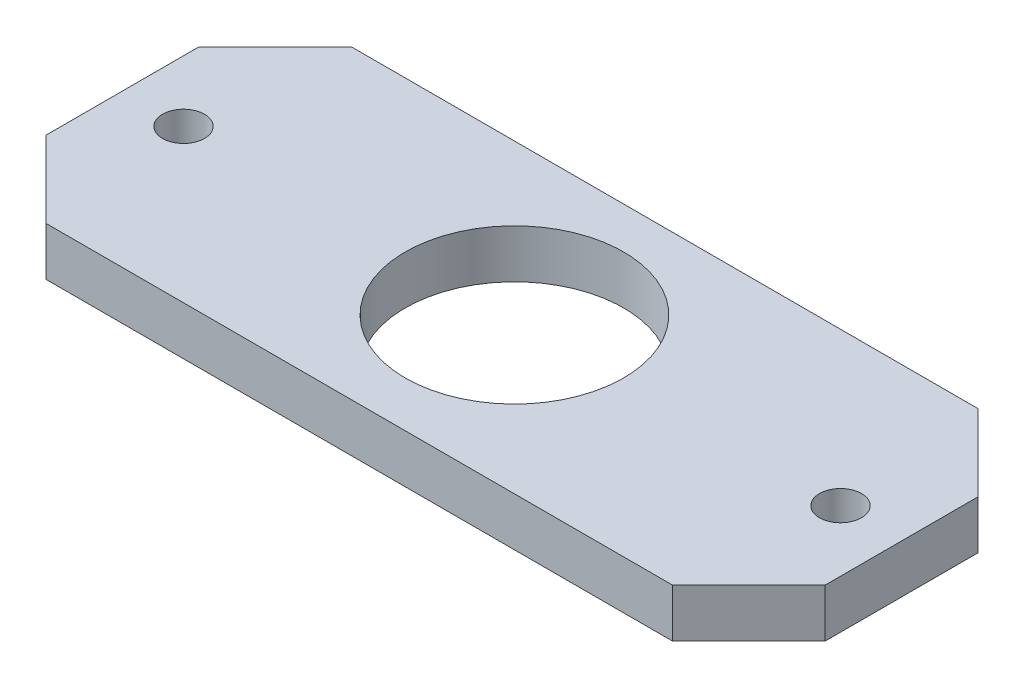
ISO-10303-21;
HEADER;
FILE_DESCRIPTION(('STEP AP214'),'2;1');
FILE_NAME('part.step','',(''),(''),'','','');
FILE_SCHEMA(('AUTOMOTIVE_DESIGN { 1 0 10303 214 1 1 1 1 }'));
ENDSEC;
DATA;
#1=APPLICATION_CONTEXT('core data for automotive mechanical design processes');
#2=APPLICATION_PROTOCOL_DEFINITION('international standard','automotive_design',2000,#1);
#3=PRODUCT_CONTEXT('',#1,'mechanical');
#4=PRODUCT('Part','Part','',(#3));
#5=PRODUCT_RELATED_PRODUCT_CATEGORY('part','',(#4));
#6=PRODUCT_DEFINITION_FORMATION('','',#4);
#7=PRODUCT_DEFINITION_CONTEXT('part definition',#1,'design');
#8=PRODUCT_DEFINITION('design','',#6,#7);
#9=PRODUCT_DEFINITION_SHAPE('','',#8);
#10=(LENGTH_UNIT() NAMED_UNIT(*) SI_UNIT(.MILLI.,.METRE.));
#11=(NAMED_UNIT(*) PLANE_ANGLE_UNIT() SI_UNIT($,.RADIAN.));
#12=(NAMED_UNIT(*) SI_UNIT($,.STERADIAN.) SOLID_ANGLE_UNIT());
#13=UNCERTAINTY_MEASURE_WITH_UNIT(LENGTH_MEASURE(1.E-05),#10,'distance_accuracy_value','');
#14=(GEOMETRIC_REPRESENTATION_CONTEXT(3) GLOBAL_UNCERTAINTY_ASSIGNED_CONTEXT((#13)) GLOBAL_UNIT_ASSIGNED_CONTEXT((#10,
#11,#12)) REPRESENTATION_CONTEXT('',''));
#15=CARTESIAN_POINT('',(0.,0.,0.));
#16=DIRECTION('',(0.,0.,1.));
#17=DIRECTION('',(1.,0.,0.));
#18=AXIS2_PLACEMENT_3D('',#15,#16,#17);
#19=CARTESIAN_POINT('',(0.,6.35,0.));
#20=DIRECTION('',(0.,-1.,0.));
#21=DIRECTION('',(0.,0.,-1.));
#22=AXIS2_PLACEMENT_3D('',#19,#20,#21);
#23=PLANE('',#22);
#24=DIRECTION('',(1.,0.,0.));
#25=VECTOR('',#24,1.);
#26=CARTESIAN_POINT('',(-14.1959183939378,6.35,-8.76310778368405));
#27=LINE('',#26,#25);
#28=CARTESIAN_POINT('',(-0.795399125952209,6.35,-8.76310778368405));
#29=VERTEX_POINT('',#28);
#30=CARTESIAN_POINT('',(81.2046008532428,6.35,-8.76310778368406));
#31=VERTEX_POINT('',#30);
#32=EDGE_CURVE('E64',#29,#31,#27,.T.);
#33=ORIENTED_EDGE('',*,*,#32,.T.);
#34=DIRECTION('',(-0.707106781186549,0.,0.707106781186546));
#35=VECTOR('',#34,1.);
#36=CARTESIAN_POINT('',(91.2046008636453,6.35,-18.7631077940865));
#37=LINE('',#36,#35);
#38=CARTESIAN_POINT('',(91.2046008636453,6.35,-18.7631077940865));
#39=VERTEX_POINT('',#38);
#40=EDGE_CURVE('E145',#31,#39,#37,.F.);
#41=ORIENTED_EDGE('',*,*,#40,.T.);
#42=DIRECTION('',(0.,0.,1.));
#43=VECTOR('',#42,1.);
#44=CARTESIAN_POINT('',(91.2046008636453,6.35,6.23689220591347));
#45=LINE('',#44,#43);
#46=CARTESIAN_POINT('',(91.2046008636453,6.35,-38.7631077940866));
#47=VERTEX_POINT('',#46);
#48=EDGE_CURVE('E157',#47,#39,#45,.T.);
#49=ORIENTED_EDGE('',*,*,#48,.F.);
#50=DIRECTION('',(0.707106781186549,0.,0.707106781186546));
#51=VECTOR('',#50,1.);
#52=CARTESIAN_POINT('',(91.2046008636453,6.35,-38.7631077940866));
#53=LINE('',#52,#51);
#54=CARTESIAN_POINT('',(81.2046008740478,6.35,-48.7631077836841));
#55=VERTEX_POINT('',#54);
#56=EDGE_CURVE('E142',#47,#55,#53,.F.);
#57=ORIENTED_EDGE('',*,*,#56,.T.);
#58=DIRECTION('',(-1.,0.,0.));
#59=VECTOR('',#58,1.);
#60=CARTESIAN_POINT('',(-14.1959183939377,6.35,-48.7631077836841));
#61=LINE('',#60,#59);
#62=CARTESIAN_POINT('',(-0.795399146757168,6.35,-48.7631077836841));
#63=VERTEX_POINT('',#62);
#64=EDGE_CURVE('E121',#55,#63,#61,.T.);
#65=ORIENTED_EDGE('',*,*,#64,.T.);
#66=DIRECTION('',(0.707106781186549,0.,-0.707106781186546));
#67=VECTOR('',#66,1.);
#68=CARTESIAN_POINT('',(-10.7953991363547,6.35,-38.7631077940866));
#69=LINE('',#68,#67);
#70=CARTESIAN_POINT('',(-10.7953991363547,6.35,-38.7631077940866));
#71=VERTEX_POINT('',#70);
#72=EDGE_CURVE('E140',#63,#71,#69,.F.);
#73=ORIENTED_EDGE('',*,*,#72,.T.);
#74=DIRECTION('',(0.,0.,-1.));
#75=VECTOR('',#74,1.);
#76=CARTESIAN_POINT('',(-10.7953991363547,6.35,6.23689220591347));
#77=LINE('',#76,#75);
#78=CARTESIAN_POINT('',(-10.7953991363547,6.35,-18.7631077940865));
#79=VERTEX_POINT('',#78);
#80=EDGE_CURVE('E150',#79,#71,#77,.T.);
#81=ORIENTED_EDGE('',*,*,#80,.F.);
#82=DIRECTION('',(-0.707106781186549,0.,-0.707106781186546));
#83=VECTOR('',#82,1.);
#84=CARTESIAN_POINT('',(-10.7953991363547,6.35,-18.7631077940865));
#85=LINE('',#84,#83);
#86=EDGE_CURVE('E138',#79,#29,#85,.F.);
#87=ORIENTED_EDGE('',*,*,#86,.T.);
#88=EDGE_LOOP('',(#33,#41,#49,#57,#65,#73,#81,#87));
#89=FACE_BOUND('',#88,.T.);
#90=CARTESIAN_POINT('',(-2.79539913635471,6.35,-28.7631077926537));
#91=DIRECTION('',(0.,-1.,0.));
#92=DIRECTION('',(0.,0.,-1.));
#93=AXIS2_PLACEMENT_3D('',#90,#91,#92);
#94=CIRCLE('',#93,2.75);
#95=CARTESIAN_POINT('',(-2.79539913635471,6.35,-31.5131077926537));
#96=VERTEX_POINT('',#95);
#97=EDGE_CURVE('E183',#96,#96,#94,.T.);
#98=ORIENTED_EDGE('',*,*,#97,.T.);
#99=EDGE_LOOP('',(#98));
#100=FACE_BOUND('',#99,.T.);
#101=CARTESIAN_POINT('',(83.2046008636453,6.35,-28.7631077836841));
#102=DIRECTION('',(0.,-1.,0.));
#103=DIRECTION('',(0.,0.,-1.));
#104=AXIS2_PLACEMENT_3D('',#101,#102,#103);
#105=CIRCLE('',#104,2.75000000000001);
#106=CARTESIAN_POINT('',(83.2046008636453,6.35,-31.5131077836841));
#107=VERTEX_POINT('',#106);
#108=EDGE_CURVE('E185',#107,#107,#105,.T.);
#109=ORIENTED_EDGE('',*,*,#108,.T.);
#110=EDGE_LOOP('',(#109));
#111=FACE_BOUND('',#110,.T.);
#112=CARTESIAN_POINT('',(40.2450257051164,6.35,-29.0406949992175));
#113=DIRECTION('',(0.,1.,0.));
#114=DIRECTION('',(0.,0.,1.));
#115=AXIS2_PLACEMENT_3D('',#112,#113,#114);
#116=CIRCLE('',#115,14.295);
#117=CARTESIAN_POINT('',(40.2450257051164,6.35,-14.7456949992175));
#118=VERTEX_POINT('',#117);
#119=EDGE_CURVE('E159',#118,#118,#116,.T.);
#120=ORIENTED_EDGE('',*,*,#119,.F.);
#121=EDGE_LOOP('',(#120));
#122=FACE_BOUND('',#121,.T.);
#123=ADVANCED_FACE('F40',(#89,#100,#111,#122),#23,.F.);
#124=CARTESIAN_POINT('',(0.,0.,0.));
#125=DIRECTION('',(0.,-1.,0.));
#126=DIRECTION('',(0.,0.,-1.));
#127=AXIS2_PLACEMENT_3D('',#124,#125,#126);
#128=PLANE('',#127);
#129=CARTESIAN_POINT('',(-2.79539913635471,0.,-28.7631077926537));
#130=DIRECTION('',(0.,-1.,0.));
#131=DIRECTION('',(0.,0.,-1.));
#132=AXIS2_PLACEMENT_3D('',#129,#130,#131);
#133=CIRCLE('',#132,2.75);
#134=CARTESIAN_POINT('',(-2.79539913635471,0.,-31.5131077926537));
#135=VERTEX_POINT('',#134);
#136=EDGE_CURVE('E190',#135,#135,#133,.T.);
#137=ORIENTED_EDGE('',*,*,#136,.F.);
#138=EDGE_LOOP('',(#137));
#139=FACE_BOUND('',#138,.T.);
#140=CARTESIAN_POINT('',(83.2046008636453,0.,-28.7631077836841));
#141=DIRECTION('',(0.,-1.,0.));
#142=DIRECTION('',(0.,0.,-1.));
#143=AXIS2_PLACEMENT_3D('',#140,#141,#142);
#144=CIRCLE('',#143,2.75000000000001);
#145=CARTESIAN_POINT('',(83.2046008636453,0.,-31.5131077836841));
#146=VERTEX_POINT('',#145);
#147=EDGE_CURVE('E191',#146,#146,#144,.T.);
#148=ORIENTED_EDGE('',*,*,#147,.F.);
#149=EDGE_LOOP('',(#148));
#150=FACE_BOUND('',#149,.T.);
#151=CARTESIAN_POINT('',(40.2450257051164,0.,-29.0406949992175));
#152=DIRECTION('',(0.,1.,0.));
#153=DIRECTION('',(0.,0.,1.));
#154=AXIS2_PLACEMENT_3D('',#151,#152,#153);
#155=CIRCLE('',#154,14.295);
#156=CARTESIAN_POINT('',(40.2450257051164,0.,-14.7456949992175));
#157=VERTEX_POINT('',#156);
#158=EDGE_CURVE('E166',#157,#157,#155,.T.);
#159=ORIENTED_EDGE('',*,*,#158,.T.);
#160=EDGE_LOOP('',(#159));
#161=FACE_BOUND('',#160,.T.);
#162=DIRECTION('',(0.707106781186549,0.,-0.707106781186546));
#163=VECTOR('',#162,1.);
#164=CARTESIAN_POINT('',(36.2207465347792,0.,36.2207465347794));
#165=LINE('',#164,#163);
#166=CARTESIAN_POINT('',(91.2046008636453,0.,-18.7631077940865));
#167=VERTEX_POINT('',#166);
#168=CARTESIAN_POINT('',(81.2046008532428,0.,-8.76310778368405));
#169=VERTEX_POINT('',#168);
#170=EDGE_CURVE('E120',#167,#169,#165,.F.);
#171=ORIENTED_EDGE('',*,*,#170,.T.);
#172=DIRECTION('',(-1.,0.,0.));
#173=VECTOR('',#172,1.);
#174=CARTESIAN_POINT('',(-14.1959183939378,0.,-8.76310778368405));
#175=LINE('',#174,#173);
#176=CARTESIAN_POINT('',(-0.79539912595221,0.,-8.76310778368405));
#177=VERTEX_POINT('',#176);
#178=EDGE_CURVE('E106',#169,#177,#175,.T.);
#179=ORIENTED_EDGE('',*,*,#178,.T.);
#180=DIRECTION('',(0.707106781186549,0.,0.707106781186546));
#181=VECTOR('',#180,1.);
#182=CARTESIAN_POINT('',(3.98385432886592,0.,-3.98385432886594));
#183=LINE('',#182,#181);
#184=CARTESIAN_POINT('',(-10.7953991363547,0.,-18.7631077940865));
#185=VERTEX_POINT('',#184);
#186=EDGE_CURVE('E117',#177,#185,#183,.F.);
#187=ORIENTED_EDGE('',*,*,#186,.T.);
#188=DIRECTION('',(0.,0.,1.));
#189=VECTOR('',#188,1.);
#190=CARTESIAN_POINT('',(-10.7953991363547,0.,6.23689220591347));
#191=LINE('',#190,#189);
#192=CARTESIAN_POINT('',(-10.7953991363547,0.,-38.7631077940866));
#193=VERTEX_POINT('',#192);
#194=EDGE_CURVE('E152',#193,#185,#191,.T.);
#195=ORIENTED_EDGE('',*,*,#194,.F.);
#196=DIRECTION('',(-0.707106781186549,0.,0.707106781186546));
#197=VECTOR('',#196,1.);
#198=CARTESIAN_POINT('',(-24.7792534652206,0.,-24.7792534652207));
#199=LINE('',#198,#197);
#200=CARTESIAN_POINT('',(-0.795399146757164,0.,-48.7631077836841));
#201=VERTEX_POINT('',#200);
#202=EDGE_CURVE('E125',#193,#201,#199,.F.);
#203=ORIENTED_EDGE('',*,*,#202,.T.);
#204=DIRECTION('',(1.,0.,0.));
#205=VECTOR('',#204,1.);
#206=CARTESIAN_POINT('',(-14.1959183939377,0.,-48.7631077836841));
#207=LINE('',#206,#205);
#208=CARTESIAN_POINT('',(81.2046008740477,0.,-48.7631077836841));
#209=VERTEX_POINT('',#208);
#210=EDGE_CURVE('E56',#201,#209,#207,.T.);
#211=ORIENTED_EDGE('',*,*,#210,.T.);
#212=DIRECTION('',(-0.707106781186549,0.,-0.707106781186546));
#213=VECTOR('',#212,1.);
#214=CARTESIAN_POINT('',(64.9838543288658,0.,-64.983854328866));
#215=LINE('',#214,#213);
#216=CARTESIAN_POINT('',(91.2046008636453,0.,-38.7631077940866));
#217=VERTEX_POINT('',#216);
#218=EDGE_CURVE('E129',#209,#217,#215,.F.);
#219=ORIENTED_EDGE('',*,*,#218,.T.);
#220=DIRECTION('',(0.,0.,-1.));
#221=VECTOR('',#220,1.);
#222=CARTESIAN_POINT('',(91.2046008636453,0.,6.23689220591347));
#223=LINE('',#222,#221);
#224=EDGE_CURVE('E162',#167,#217,#223,.T.);
#225=ORIENTED_EDGE('',*,*,#224,.F.);
#226=EDGE_LOOP('',(#171,#179,#187,#195,#203,#211,#219,#225));
#227=FACE_BOUND('',#226,.T.);
#228=ADVANCED_FACE('F115',(#139,#150,#161,#227),#128,.T.);
#229=CARTESIAN_POINT('',(40.2450257051164,0.,-29.0406949992175));
#230=DIRECTION('',(0.,1.,0.));
#231=DIRECTION('',(0.,0.,1.));
#232=AXIS2_PLACEMENT_3D('',#229,#230,#231);
#233=CYLINDRICAL_SURFACE('',#232,14.295);
#234=ORIENTED_EDGE('',*,*,#158,.F.);
#235=EDGE_LOOP('',(#234));
#236=FACE_BOUND('',#235,.T.);
#237=ORIENTED_EDGE('',*,*,#119,.T.);
#238=EDGE_LOOP('',(#237));
#239=FACE_BOUND('',#238,.T.);
#240=ADVANCED_FACE('F222',(#236,#239),#233,.F.);
#241=CARTESIAN_POINT('',(-10.7953991363547,0.,0.));
#242=DIRECTION('',(1.,0.,0.));
#243=DIRECTION('',(0.,0.,-1.));
#244=AXIS2_PLACEMENT_3D('',#241,#242,#243);
#245=PLANE('',#244);
#246=ORIENTED_EDGE('',*,*,#80,.T.);
#247=DIRECTION('',(0.,-1.,0.));
#248=VECTOR('',#247,1.);
#249=CARTESIAN_POINT('',(-10.7953991363547,0.,-38.7631077940866));
#250=LINE('',#249,#248);
#251=EDGE_CURVE('E11',#71,#193,#250,.T.);
#252=ORIENTED_EDGE('',*,*,#251,.T.);
#253=ORIENTED_EDGE('',*,*,#194,.T.);
#254=DIRECTION('',(0.,1.,0.));
#255=VECTOR('',#254,1.);
#256=CARTESIAN_POINT('',(-10.7953991363547,0.,-18.7631077940865));
#257=LINE('',#256,#255);
#258=EDGE_CURVE('E49',#185,#79,#257,.T.);
#259=ORIENTED_EDGE('',*,*,#258,.T.);
#260=EDGE_LOOP('',(#246,#252,#253,#259));
#261=FACE_BOUND('',#260,.T.);
#262=ADVANCED_FACE('F149',(#261),#245,.F.);
#263=CARTESIAN_POINT('',(91.2046008636453,0.,0.));
#264=DIRECTION('',(-1.,0.,0.));
#265=DIRECTION('',(0.,0.,1.));
#266=AXIS2_PLACEMENT_3D('',#263,#264,#265);
#267=PLANE('',#266);
#268=ORIENTED_EDGE('',*,*,#48,.T.);
#269=DIRECTION('',(0.,-1.,0.));
#270=VECTOR('',#269,1.);
#271=CARTESIAN_POINT('',(91.2046008636453,0.,-18.7631077940865));
#272=LINE('',#271,#270);
#273=EDGE_CURVE('E126',#39,#167,#272,.T.);
#274=ORIENTED_EDGE('',*,*,#273,.T.);
#275=ORIENTED_EDGE('',*,*,#224,.T.);
#276=DIRECTION('',(0.,1.,0.));
#277=VECTOR('',#276,1.);
#278=CARTESIAN_POINT('',(91.2046008636453,0.,-38.7631077940866));
#279=LINE('',#278,#277);
#280=EDGE_CURVE('E132',#217,#47,#279,.T.);
#281=ORIENTED_EDGE('',*,*,#280,.T.);
#282=EDGE_LOOP('',(#268,#274,#275,#281));
#283=FACE_BOUND('',#282,.T.);
#284=ADVANCED_FACE('F175',(#283),#267,.F.);
#285=CARTESIAN_POINT('',(83.2046008636453,10.,-28.7631077836841));
#286=DIRECTION('',(0.,-1.,0.));
#287=DIRECTION('',(0.,0.,-1.));
#288=AXIS2_PLACEMENT_3D('',#285,#286,#287);
#289=CYLINDRICAL_SURFACE('',#288,2.75000000000001);
#290=ORIENTED_EDGE('',*,*,#147,.T.);
#291=EDGE_LOOP('',(#290));
#292=FACE_BOUND('',#291,.T.);
#293=ORIENTED_EDGE('',*,*,#108,.F.);
#294=EDGE_LOOP('',(#293));
#295=FACE_BOUND('',#294,.T.);
#296=ADVANCED_FACE('F242',(#292,#295),#289,.F.);
#297=CARTESIAN_POINT('',(-2.79539913635471,10.,-28.7631077926537));
#298=DIRECTION('',(0.,-1.,0.));
#299=DIRECTION('',(0.,0.,-1.));
#300=AXIS2_PLACEMENT_3D('',#297,#298,#299);
#301=CYLINDRICAL_SURFACE('',#300,2.75);
#302=ORIENTED_EDGE('',*,*,#136,.T.);
#303=EDGE_LOOP('',(#302));
#304=FACE_BOUND('',#303,.T.);
#305=ORIENTED_EDGE('',*,*,#97,.F.);
#306=EDGE_LOOP('',(#305));
#307=FACE_BOUND('',#306,.T.);
#308=ADVANCED_FACE('F213',(#304,#307),#301,.F.);
#309=CARTESIAN_POINT('',(91.2046008636453,0.,-18.7631077940865));
#310=DIRECTION('',(-0.707106781186546,0.,-0.707106781186549));
#311=DIRECTION('',(0.,-1.,0.));
#312=AXIS2_PLACEMENT_3D('',#309,#310,#311);
#313=PLANE('',#312);
#314=ORIENTED_EDGE('',*,*,#40,.F.);
#315=DIRECTION('',(0.,-1.,0.));
#316=VECTOR('',#315,1.);
#317=CARTESIAN_POINT('',(81.2046008532428,6.351,-8.76310778368405));
#318=LINE('',#317,#316);
#319=EDGE_CURVE('E182',#169,#31,#318,.F.);
#320=ORIENTED_EDGE('',*,*,#319,.F.);
#321=ORIENTED_EDGE('',*,*,#170,.F.);
#322=ORIENTED_EDGE('',*,*,#273,.F.);
#323=EDGE_LOOP('',(#314,#320,#321,#322));
#324=FACE_BOUND('',#323,.T.);
#325=ADVANCED_FACE('F181',(#324),#313,.F.);
#326=CARTESIAN_POINT('',(91.2046008636453,0.,-38.7631077940866));
#327=DIRECTION('',(-0.707106781186546,0.,0.707106781186549));
#328=DIRECTION('',(0.,1.,0.));
#329=AXIS2_PLACEMENT_3D('',#326,#327,#328);
#330=PLANE('',#329);
#331=ORIENTED_EDGE('',*,*,#218,.F.);
#332=DIRECTION('',(0.,1.,0.));
#333=VECTOR('',#332,1.);
#334=CARTESIAN_POINT('',(81.2046008740478,6.351,-48.7631077836841));
#335=LINE('',#334,#333);
#336=EDGE_CURVE('E200',#55,#209,#335,.F.);
#337=ORIENTED_EDGE('',*,*,#336,.F.);
#338=ORIENTED_EDGE('',*,*,#56,.F.);
#339=ORIENTED_EDGE('',*,*,#280,.F.);
#340=EDGE_LOOP('',(#331,#337,#338,#339));
#341=FACE_BOUND('',#340,.T.);
#342=ADVANCED_FACE('F206',(#341),#330,.F.);
#343=CARTESIAN_POINT('',(-10.7953991363547,0.,-38.7631077940866));
#344=DIRECTION('',(0.707106781186546,0.,0.707106781186549));
#345=DIRECTION('',(0.,-1.,0.));
#346=AXIS2_PLACEMENT_3D('',#343,#344,#345);
#347=PLANE('',#346);
#348=ORIENTED_EDGE('',*,*,#72,.F.);
#349=DIRECTION('',(0.,-1.,0.));
#350=VECTOR('',#349,1.);
#351=CARTESIAN_POINT('',(-0.795399146757169,6.351,-48.7631077836841));
#352=LINE('',#351,#350);
#353=EDGE_CURVE('E111',#201,#63,#352,.F.);
#354=ORIENTED_EDGE('',*,*,#353,.F.);
#355=ORIENTED_EDGE('',*,*,#202,.F.);
#356=ORIENTED_EDGE('',*,*,#251,.F.);
#357=EDGE_LOOP('',(#348,#354,#355,#356));
#358=FACE_BOUND('',#357,.T.);
#359=ADVANCED_FACE('F205',(#358),#347,.F.);
#360=CARTESIAN_POINT('',(-10.7953991363547,0.,-18.7631077940865));
#361=DIRECTION('',(0.707106781186546,0.,-0.707106781186549));
#362=DIRECTION('',(0.,1.,0.));
#363=AXIS2_PLACEMENT_3D('',#360,#361,#362);
#364=PLANE('',#363);
#365=ORIENTED_EDGE('',*,*,#186,.F.);
#366=DIRECTION('',(0.,1.,0.));
#367=VECTOR('',#366,1.);
#368=CARTESIAN_POINT('',(-0.795399125952209,6.351,-8.76310778368405));
#369=LINE('',#368,#367);
#370=EDGE_CURVE('E103',#29,#177,#369,.F.);
#371=ORIENTED_EDGE('',*,*,#370,.F.);
#372=ORIENTED_EDGE('',*,*,#86,.F.);
#373=ORIENTED_EDGE('',*,*,#258,.F.);
#374=EDGE_LOOP('',(#365,#371,#372,#373));
#375=FACE_BOUND('',#374,.T.);
#376=ADVANCED_FACE('F43',(#375),#364,.F.);
#377=CARTESIAN_POINT('',(-14.1959183939378,6.351,-8.76310778368405));
#378=DIRECTION('',(0.,0.,1.));
#379=DIRECTION('',(1.,0.,0.));
#380=AXIS2_PLACEMENT_3D('',#377,#378,#379);
#381=PLANE('',#380);
#382=ORIENTED_EDGE('',*,*,#178,.F.);
#383=ORIENTED_EDGE('',*,*,#319,.T.);
#384=ORIENTED_EDGE('',*,*,#32,.F.);
#385=ORIENTED_EDGE('',*,*,#370,.T.);
#386=EDGE_LOOP('',(#382,#383,#384,#385));
#387=FACE_BOUND('',#386,.T.);
#388=ADVANCED_FACE('F105',(#387),#381,.T.);
#389=CARTESIAN_POINT('',(-14.1959183939377,6.351,-48.7631077836841));
#390=DIRECTION('',(0.,0.,-1.));
#391=DIRECTION('',(-1.,0.,0.));
#392=AXIS2_PLACEMENT_3D('',#389,#390,#391);
#393=PLANE('',#392);
#394=ORIENTED_EDGE('',*,*,#64,.F.);
#395=ORIENTED_EDGE('',*,*,#336,.T.);
#396=ORIENTED_EDGE('',*,*,#210,.F.);
#397=ORIENTED_EDGE('',*,*,#353,.T.);
#398=EDGE_LOOP('',(#394,#395,#396,#397));
#399=FACE_BOUND('',#398,.T.);
#400=ADVANCED_FACE('F202',(#399),#393,.T.);
#401=CLOSED_SHELL('',(#123,#228,#240,#262,#284,#296,#308,#325,#342,#359,#376,#388,#400));
#402=MANIFOLD_SOLID_BREP('B2',#401);
#403=ADVANCED_BREP_SHAPE_REPRESENTATION('',(#18,#402),#14);
#404=SHAPE_DEFINITION_REPRESENTATION(#9,#403);
ENDSEC;
END-ISO-10303-21;
